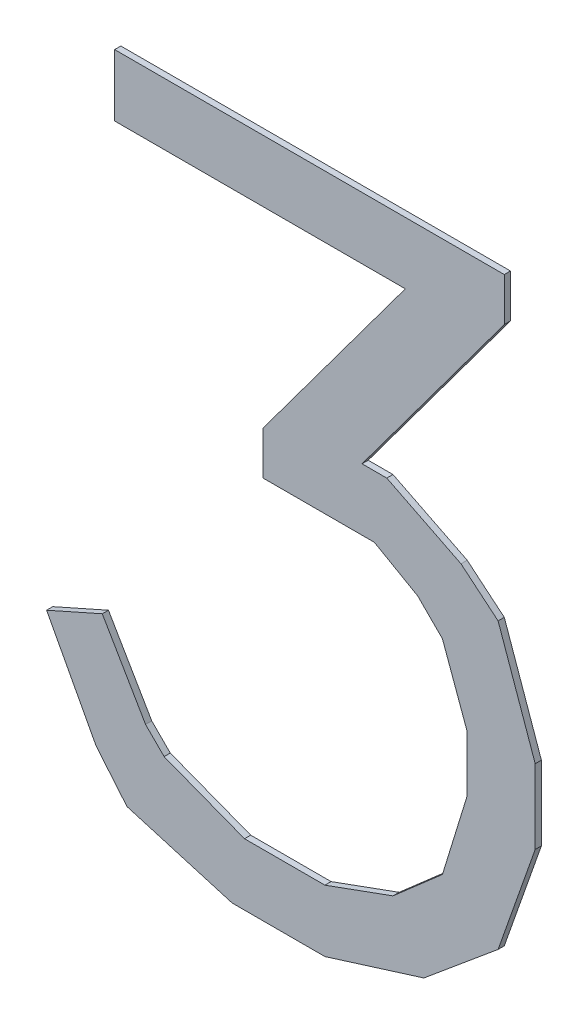
ISO-10303-21;
HEADER;
FILE_DESCRIPTION(('STEP AP214'),'2;1');
FILE_NAME('part.step','',(''),(''),'','','');
FILE_SCHEMA(('AUTOMOTIVE_DESIGN { 1 0 10303 214 1 1 1 1 }'));
ENDSEC;
DATA;
#1=APPLICATION_CONTEXT('core data for automotive mechanical design processes');
#2=APPLICATION_PROTOCOL_DEFINITION('international standard','automotive_design',2000,#1);
#3=PRODUCT_CONTEXT('',#1,'mechanical');
#4=PRODUCT('Part','Part','',(#3));
#5=PRODUCT_RELATED_PRODUCT_CATEGORY('part','',(#4));
#6=PRODUCT_DEFINITION_FORMATION('','',#4);
#7=PRODUCT_DEFINITION_CONTEXT('part definition',#1,'design');
#8=PRODUCT_DEFINITION('design','',#6,#7);
#9=PRODUCT_DEFINITION_SHAPE('','',#8);
#10=(LENGTH_UNIT() NAMED_UNIT(*) SI_UNIT(.MILLI.,.METRE.));
#11=(NAMED_UNIT(*) PLANE_ANGLE_UNIT() SI_UNIT($,.RADIAN.));
#12=(NAMED_UNIT(*) SI_UNIT($,.STERADIAN.) SOLID_ANGLE_UNIT());
#13=UNCERTAINTY_MEASURE_WITH_UNIT(LENGTH_MEASURE(1.E-05),#10,'distance_accuracy_value','');
#14=(GEOMETRIC_REPRESENTATION_CONTEXT(3) GLOBAL_UNCERTAINTY_ASSIGNED_CONTEXT((#13)) GLOBAL_UNIT_ASSIGNED_CONTEXT((#10,
#11,#12)) REPRESENTATION_CONTEXT('',''));
#15=CARTESIAN_POINT('',(0.,0.,0.));
#16=DIRECTION('',(0.,0.,1.));
#17=DIRECTION('',(1.,0.,0.));
#18=AXIS2_PLACEMENT_3D('',#15,#16,#17);
#19=CARTESIAN_POINT('',(-0.2850007,0.55000144,0.01));
#20=DIRECTION('',(0.,0.,1.));
#21=DIRECTION('',(1.,0.,0.));
#22=AXIS2_PLACEMENT_3D('',#19,#20,#21);
#23=PLANE('',#22);
#24=DIRECTION('',(1.,0.,0.));
#25=VECTOR('',#24,1.);
#26=CARTESIAN_POINT('',(0.11500104,0.1700022,0.01));
#27=LINE('',#26,#25);
#28=CARTESIAN_POINT('',(0.115001040000038,0.170002199999972,0.01));
#29=VERTEX_POINT('',#28);
#30=CARTESIAN_POINT('',(0.15500096,0.1700022,0.01));
#31=VERTEX_POINT('',#30);
#32=EDGE_CURVE('E378',#29,#31,#27,.T.);
#33=ORIENTED_EDGE('',*,*,#32,.F.);
#34=DIRECTION('',(0.595846924173071,0.803098028234095,0.));
#35=VECTOR('',#34,1.);
#36=CARTESIAN_POINT('',(0.34500058,0.48000158,0.01));
#37=LINE('',#36,#35);
#38=CARTESIAN_POINT('',(0.34500058,0.48000158,0.01));
#39=VERTEX_POINT('',#38);
#40=EDGE_CURVE('E383',#39,#29,#37,.F.);
#41=ORIENTED_EDGE('',*,*,#40,.F.);
#42=DIRECTION('',(0.,1.,0.));
#43=VECTOR('',#42,1.);
#44=CARTESIAN_POINT('',(0.34500058,0.55000144,0.01));
#45=LINE('',#44,#43);
#46=CARTESIAN_POINT('',(0.34500058,0.55000144,0.01));
#47=VERTEX_POINT('',#46);
#48=EDGE_CURVE('E226',#47,#39,#45,.F.);
#49=ORIENTED_EDGE('',*,*,#48,.F.);
#50=DIRECTION('',(1.,0.,0.));
#51=VECTOR('',#50,1.);
#52=CARTESIAN_POINT('',(-0.2850007,0.55000144,0.01));
#53=LINE('',#52,#51);
#54=CARTESIAN_POINT('',(-0.2850007,0.55000144,0.01));
#55=VERTEX_POINT('',#54);
#56=EDGE_CURVE('E20',#55,#47,#53,.T.);
#57=ORIENTED_EDGE('',*,*,#56,.F.);
#58=DIRECTION('',(0.,1.,0.));
#59=VECTOR('',#58,1.);
#60=CARTESIAN_POINT('',(-0.2850007,0.45000164,0.01));
#61=LINE('',#60,#59);
#62=CARTESIAN_POINT('',(-0.2850007,0.45000164,0.01));
#63=VERTEX_POINT('',#62);
#64=EDGE_CURVE('E223',#63,#55,#61,.T.);
#65=ORIENTED_EDGE('',*,*,#64,.F.);
#66=DIRECTION('',(1.,0.,0.));
#67=VECTOR('',#66,1.);
#68=CARTESIAN_POINT('',(0.1850009,0.45000164,0.01));
#69=LINE('',#68,#67);
#70=CARTESIAN_POINT('',(0.185000899999997,0.450001640000002,0.01));
#71=VERTEX_POINT('',#70);
#72=EDGE_CURVE('E244',#71,#63,#69,.F.);
#73=ORIENTED_EDGE('',*,*,#72,.F.);
#74=DIRECTION('',(-0.5958511681797,-0.803094879437596,0.));
#75=VECTOR('',#74,1.);
#76=CARTESIAN_POINT('',(-0.04500118,0.14000226,0.01));
#77=LINE('',#76,#75);
#78=CARTESIAN_POINT('',(-0.04500118,0.14000226,0.01));
#79=VERTEX_POINT('',#78);
#80=EDGE_CURVE('E248',#79,#71,#77,.F.);
#81=ORIENTED_EDGE('',*,*,#80,.F.);
#82=DIRECTION('',(0.,1.,0.));
#83=VECTOR('',#82,1.);
#84=CARTESIAN_POINT('',(-0.04500118,0.07000240000001,0.01));
#85=LINE('',#84,#83);
#86=CARTESIAN_POINT('',(-0.04500118,0.07000240000001,0.01));
#87=VERTEX_POINT('',#86);
#88=EDGE_CURVE('E253',#87,#79,#85,.T.);
#89=ORIENTED_EDGE('',*,*,#88,.F.);
#90=DIRECTION('',(1.,0.,0.));
#91=VECTOR('',#90,1.);
#92=CARTESIAN_POINT('',(0.135001,0.07000240000001,0.01));
#93=LINE('',#92,#91);
#94=CARTESIAN_POINT('',(0.135001000000007,0.0700024000000172,0.01));
#95=VERTEX_POINT('',#94);
#96=EDGE_CURVE('E258',#95,#87,#93,.F.);
#97=ORIENTED_EDGE('',*,*,#96,.F.);
#98=DIRECTION('',(0.868243142124275,-0.496138938357157,0.));
#99=VECTOR('',#98,1.);
#100=CARTESIAN_POINT('',(0.20500086,0.03000248000001,0.01));
#101=LINE('',#100,#99);
#102=CARTESIAN_POINT('',(0.20500086,0.0300024800000097,0.01));
#103=VERTEX_POINT('',#102);
#104=EDGE_CURVE('E263',#103,#95,#101,.F.);
#105=ORIENTED_EDGE('',*,*,#104,.F.);
#106=DIRECTION('',(0.707106781186548,-0.707106781186548,0.));
#107=VECTOR('',#106,1.);
#108=CARTESIAN_POINT('',(0.24500078,-0.009997439999992,0.01));
#109=LINE('',#108,#107);
#110=CARTESIAN_POINT('',(0.245000779999989,-0.00999744000000011,0.01));
#111=VERTEX_POINT('',#110);
#112=EDGE_CURVE('E268',#111,#103,#109,.F.);
#113=ORIENTED_EDGE('',*,*,#112,.F.);
#114=DIRECTION('',(0.341743063087106,-0.939793423488291,0.));
#115=VECTOR('',#114,1.);
#116=CARTESIAN_POINT('',(0.2850007,-0.11999722,0.01));
#117=LINE('',#116,#115);
#118=CARTESIAN_POINT('',(0.2850007,-0.11999722,0.01));
#119=VERTEX_POINT('',#118);
#120=EDGE_CURVE('E273',#119,#111,#117,.F.);
#121=ORIENTED_EDGE('',*,*,#120,.F.);
#122=DIRECTION('',(0.,1.,0.));
#123=VECTOR('',#122,1.);
#124=CARTESIAN_POINT('',(0.2850007,-0.20999958,0.01));
#125=LINE('',#124,#123);
#126=CARTESIAN_POINT('',(0.285000700000014,-0.209999580000004,0.01));
#127=VERTEX_POINT('',#126);
#128=EDGE_CURVE('E278',#127,#119,#125,.T.);
#129=ORIENTED_EDGE('',*,*,#128,.F.);
#130=DIRECTION('',(-0.294085848837945,-0.95577900872182,0.));
#131=VECTOR('',#130,1.);
#132=CARTESIAN_POINT('',(0.24500078,-0.33999932,0.01));
#133=LINE('',#132,#131);
#134=CARTESIAN_POINT('',(0.245000779999995,-0.339999319999994,0.01));
#135=VERTEX_POINT('',#134);
#136=EDGE_CURVE('E283',#135,#127,#133,.F.);
#137=ORIENTED_EDGE('',*,*,#136,.F.);
#138=DIRECTION('',(-0.752576694706692,-0.658504607868731,0.));
#139=VECTOR('',#138,1.);
#140=CARTESIAN_POINT('',(0.16500094,-0.40999918,0.01));
#141=LINE('',#140,#139);
#142=CARTESIAN_POINT('',(0.165000939999995,-0.409999179999986,0.01));
#143=VERTEX_POINT('',#142);
#144=EDGE_CURVE('E288',#143,#135,#141,.F.);
#145=ORIENTED_EDGE('',*,*,#144,.F.);
#146=DIRECTION('',(-0.939795957802303,-0.34173609364311,0.));
#147=VECTOR('',#146,1.);
#148=CARTESIAN_POINT('',(0.05499862000001,-0.4499991,0.01));
#149=LINE('',#148,#147);
#150=CARTESIAN_POINT('',(0.05499862000001,-0.4499991,0.01));
#151=VERTEX_POINT('',#150);
#152=EDGE_CURVE('E293',#151,#143,#149,.F.);
#153=ORIENTED_EDGE('',*,*,#152,.F.);
#154=DIRECTION('',(1.,0.,0.));
#155=VECTOR('',#154,1.);
#156=CARTESIAN_POINT('',(-0.07500112,-0.4499991,0.01));
#157=LINE('',#156,#155);
#158=CARTESIAN_POINT('',(-0.0750011200000019,-0.449999100000005,0.01));
#159=VERTEX_POINT('',#158);
#160=EDGE_CURVE('E298',#159,#151,#157,.T.);
#161=ORIENTED_EDGE('',*,*,#160,.F.);
#162=DIRECTION('',(-0.933345606203008,0.358979079309003,0.));
#163=VECTOR('',#162,1.);
#164=CARTESIAN_POINT('',(-0.20500086,-0.3999992,0.01));
#165=LINE('',#164,#163);
#166=CARTESIAN_POINT('',(-0.20500086,-0.3999992,0.01));
#167=VERTEX_POINT('',#166);
#168=EDGE_CURVE('E303',#167,#159,#165,.F.);
#169=ORIENTED_EDGE('',*,*,#168,.F.);
#170=DIRECTION('',(-0.707106781186548,0.707106781186548,0.));
#171=VECTOR('',#170,1.);
#172=CARTESIAN_POINT('',(-0.2350008,-0.36999926,0.01));
#173=LINE('',#172,#171);
#174=CARTESIAN_POINT('',(-0.235000799999996,-0.369999259999998,0.01));
#175=VERTEX_POINT('',#174);
#176=EDGE_CURVE('E308',#175,#167,#173,.F.);
#177=ORIENTED_EDGE('',*,*,#176,.F.);
#178=DIRECTION('',(-0.503871025524211,0.863778900898361,0.));
#179=VECTOR('',#178,1.);
#180=CARTESIAN_POINT('',(-0.30500066,-0.2499995,0.01));
#181=LINE('',#180,#179);
#182=CARTESIAN_POINT('',(-0.305000659999997,-0.249999500000007,0.01));
#183=VERTEX_POINT('',#182);
#184=EDGE_CURVE('E313',#183,#175,#181,.F.);
#185=ORIENTED_EDGE('',*,*,#184,.F.);
#186=DIRECTION('',(-0.913811548620381,-0.406138466053169,0.));
#187=VECTOR('',#186,1.);
#188=CARTESIAN_POINT('',(-0.39500048,-0.28999942,0.01));
#189=LINE('',#188,#187);
#190=CARTESIAN_POINT('',(-0.395000480000004,-0.289999420000002,0.01));
#191=VERTEX_POINT('',#190);
#192=EDGE_CURVE('E318',#191,#183,#189,.F.);
#193=ORIENTED_EDGE('',*,*,#192,.F.);
#194=DIRECTION('',(0.470588235294222,-0.882352941176415,0.));
#195=VECTOR('',#194,1.);
#196=CARTESIAN_POINT('',(-0.31500064,-0.43999912,0.01));
#197=LINE('',#196,#195);
#198=CARTESIAN_POINT('',(-0.315000639999998,-0.439999119999998,0.01));
#199=VERTEX_POINT('',#198);
#200=EDGE_CURVE('E323',#199,#191,#197,.F.);
#201=ORIENTED_EDGE('',*,*,#200,.F.);
#202=DIRECTION('',(0.640184399664382,-0.768221279597458,0.));
#203=VECTOR('',#202,1.);
#204=CARTESIAN_POINT('',(-0.26500074,-0.499999,0.01));
#205=LINE('',#204,#203);
#206=CARTESIAN_POINT('',(-0.265000739999994,-0.499998999999978,0.01));
#207=VERTEX_POINT('',#206);
#208=EDGE_CURVE('E328',#207,#199,#205,.F.);
#209=ORIENTED_EDGE('',*,*,#208,.F.);
#210=DIRECTION('',(0.959365501571127,-0.282166323992037,0.));
#211=VECTOR('',#210,1.);
#212=CARTESIAN_POINT('',(-0.09500108,-0.5499989,0.01));
#213=LINE('',#212,#211);
#214=CARTESIAN_POINT('',(-0.09500108,-0.5499989,0.01));
#215=VERTEX_POINT('',#214);
#216=EDGE_CURVE('E333',#215,#207,#213,.F.);
#217=ORIENTED_EDGE('',*,*,#216,.F.);
#218=DIRECTION('',(1.,0.,0.));
#219=VECTOR('',#218,1.);
#220=CARTESIAN_POINT('',(0.05499862000001,-0.5499989,0.01));
#221=LINE('',#220,#219);
#222=CARTESIAN_POINT('',(0.0549986200000127,-0.549998900000009,0.01));
#223=VERTEX_POINT('',#222);
#224=EDGE_CURVE('E338',#223,#215,#221,.F.);
#225=ORIENTED_EDGE('',*,*,#224,.F.);
#226=DIRECTION('',(0.954481326084,0.298270679345,0.));
#227=VECTOR('',#226,1.);
#228=CARTESIAN_POINT('',(0.21500084,-0.499999,0.01));
#229=LINE('',#228,#227);
#230=CARTESIAN_POINT('',(0.215000839999997,-0.499998999999996,0.01));
#231=VERTEX_POINT('',#230);
#232=EDGE_CURVE('E343',#231,#223,#229,.F.);
#233=ORIENTED_EDGE('',*,*,#232,.F.);
#234=DIRECTION('',(0.768221279597458,0.640184399664382,0.));
#235=VECTOR('',#234,1.);
#236=CARTESIAN_POINT('',(0.3350006,-0.3999992,0.01));
#237=LINE('',#236,#235);
#238=CARTESIAN_POINT('',(0.335000600000007,-0.399999200000002,0.01));
#239=VERTEX_POINT('',#238);
#240=EDGE_CURVE('E348',#239,#231,#237,.F.);
#241=ORIENTED_EDGE('',*,*,#240,.F.);
#242=DIRECTION('',(0.332820117734981,0.942990333582945,0.));
#243=VECTOR('',#242,1.);
#244=CARTESIAN_POINT('',(0.39500048,-0.22999954,0.01));
#245=LINE('',#244,#243);
#246=CARTESIAN_POINT('',(0.39500048,-0.22999954,0.01));
#247=VERTEX_POINT('',#246);
#248=EDGE_CURVE('E353',#247,#239,#245,.F.);
#249=ORIENTED_EDGE('',*,*,#248,.F.);
#250=DIRECTION('',(0.,1.,0.));
#251=VECTOR('',#250,1.);
#252=CARTESIAN_POINT('',(0.39500048,-0.10999724,0.01));
#253=LINE('',#252,#251);
#254=CARTESIAN_POINT('',(0.395000479999993,-0.109997240000003,0.01));
#255=VERTEX_POINT('',#254);
#256=EDGE_CURVE('E358',#255,#247,#253,.F.);
#257=ORIENTED_EDGE('',*,*,#256,.F.);
#258=DIRECTION('',(-0.332820117734981,0.942990333582945,0.));
#259=VECTOR('',#258,1.);
#260=CARTESIAN_POINT('',(0.3350006,0.06000242,0.01));
#261=LINE('',#260,#259);
#262=CARTESIAN_POINT('',(0.335000600000002,0.0600024200000019,0.01));
#263=VERTEX_POINT('',#262);
#264=EDGE_CURVE('E363',#263,#255,#261,.F.);
#265=ORIENTED_EDGE('',*,*,#264,.F.);
#266=DIRECTION('',(-0.768221279597458,0.640184399664382,0.));
#267=VECTOR('',#266,1.);
#268=CARTESIAN_POINT('',(0.27500072,0.11000232,0.01));
#269=LINE('',#268,#267);
#270=CARTESIAN_POINT('',(0.27500072,0.11000232,0.01));
#271=VERTEX_POINT('',#270);
#272=EDGE_CURVE('E368',#271,#263,#269,.F.);
#273=ORIENTED_EDGE('',*,*,#272,.F.);
#274=DIRECTION('',(-0.894427190999916,0.447213595499958,0.));
#275=VECTOR('',#274,1.);
#276=CARTESIAN_POINT('',(0.15500096,0.1700022,0.01));
#277=LINE('',#276,#275);
#278=EDGE_CURVE('E373',#31,#271,#277,.F.);
#279=ORIENTED_EDGE('',*,*,#278,.F.);
#280=EDGE_LOOP('',(#33,#41,#49,#57,#65,#73,#81,#89,#97,#105,#113,#121,#129,#137,#145,#153,#161,
#169,#177,#185,#193,#201,#209,#217,#225,#233,#241,#249,#257,#265,#273,#279));
#281=FACE_BOUND('',#280,.T.);
#282=ADVANCED_FACE('F17',(#281),#23,.T.);
#283=CARTESIAN_POINT('',(-0.2850007,0.55000144,0.));
#284=DIRECTION('',(0.,1.,0.));
#285=DIRECTION('',(0.,0.,1.));
#286=AXIS2_PLACEMENT_3D('',#283,#284,#285);
#287=PLANE('',#286);
#288=DIRECTION('',(0.,0.,1.));
#289=VECTOR('',#288,1.);
#290=CARTESIAN_POINT('',(-0.2850007,0.55000144,0.));
#291=LINE('',#290,#289);
#292=CARTESIAN_POINT('',(-0.2850007,0.55000144,0.));
#293=VERTEX_POINT('',#292);
#294=EDGE_CURVE('E231',#55,#293,#291,.F.);
#295=ORIENTED_EDGE('',*,*,#294,.F.);
#296=ORIENTED_EDGE('',*,*,#56,.T.);
#297=DIRECTION('',(0.,0.,-1.));
#298=VECTOR('',#297,1.);
#299=CARTESIAN_POINT('',(0.34500058,0.55000144,0.));
#300=LINE('',#299,#298);
#301=CARTESIAN_POINT('',(0.34500058,0.55000144,0.));
#302=VERTEX_POINT('',#301);
#303=EDGE_CURVE('E387',#302,#47,#300,.F.);
#304=ORIENTED_EDGE('',*,*,#303,.F.);
#305=DIRECTION('',(1.,0.,0.));
#306=VECTOR('',#305,1.);
#307=CARTESIAN_POINT('',(-0.2850007,0.55000144,0.));
#308=LINE('',#307,#306);
#309=EDGE_CURVE('E241',#302,#293,#308,.F.);
#310=ORIENTED_EDGE('',*,*,#309,.T.);
#311=EDGE_LOOP('',(#295,#296,#304,#310));
#312=FACE_BOUND('',#311,.T.);
#313=ADVANCED_FACE('F240',(#312),#287,.T.);
#314=CARTESIAN_POINT('',(-0.2850007,0.45000164,0.));
#315=DIRECTION('',(-1.,0.,0.));
#316=DIRECTION('',(0.,0.,1.));
#317=AXIS2_PLACEMENT_3D('',#314,#315,#316);
#318=PLANE('',#317);
#319=DIRECTION('',(0.,0.,-1.));
#320=VECTOR('',#319,1.);
#321=CARTESIAN_POINT('',(-0.2850007,0.45000164,0.));
#322=LINE('',#321,#320);
#323=CARTESIAN_POINT('',(-0.2850007,0.45000164,0.));
#324=VERTEX_POINT('',#323);
#325=EDGE_CURVE('E237',#63,#324,#322,.T.);
#326=ORIENTED_EDGE('',*,*,#325,.F.);
#327=ORIENTED_EDGE('',*,*,#64,.T.);
#328=ORIENTED_EDGE('',*,*,#294,.T.);
#329=DIRECTION('',(0.,1.,0.));
#330=VECTOR('',#329,1.);
#331=CARTESIAN_POINT('',(-0.2850007,0.55000144,0.));
#332=LINE('',#331,#330);
#333=EDGE_CURVE('E391',#293,#324,#332,.F.);
#334=ORIENTED_EDGE('',*,*,#333,.T.);
#335=EDGE_LOOP('',(#326,#327,#328,#334));
#336=FACE_BOUND('',#335,.T.);
#337=ADVANCED_FACE('F234',(#336),#318,.T.);
#338=CARTESIAN_POINT('',(0.1850009,0.45000164,0.));
#339=DIRECTION('',(0.,-1.,0.));
#340=DIRECTION('',(0.,0.,-1.));
#341=AXIS2_PLACEMENT_3D('',#338,#339,#340);
#342=PLANE('',#341);
#343=DIRECTION('',(0.,0.,1.));
#344=VECTOR('',#343,1.);
#345=CARTESIAN_POINT('',(0.185000899999989,0.450001640000008,0.));
#346=LINE('',#345,#344);
#347=CARTESIAN_POINT('',(0.185000899999997,0.450001640000002,0.));
#348=VERTEX_POINT('',#347);
#349=EDGE_CURVE('E246',#71,#348,#346,.F.);
#350=ORIENTED_EDGE('',*,*,#349,.F.);
#351=ORIENTED_EDGE('',*,*,#72,.T.);
#352=ORIENTED_EDGE('',*,*,#325,.T.);
#353=DIRECTION('',(1.,0.,0.));
#354=VECTOR('',#353,1.);
#355=CARTESIAN_POINT('',(-0.2850007,0.45000164,0.));
#356=LINE('',#355,#354);
#357=EDGE_CURVE('E393',#324,#348,#356,.T.);
#358=ORIENTED_EDGE('',*,*,#357,.T.);
#359=EDGE_LOOP('',(#350,#351,#352,#358));
#360=FACE_BOUND('',#359,.T.);
#361=ADVANCED_FACE('F594',(#360),#342,.T.);
#362=CARTESIAN_POINT('',(-0.04500118,0.14000226,0.));
#363=DIRECTION('',(-0.803094879437596,0.5958511681797,0.));
#364=DIRECTION('',(-0.5958511681797,-0.803094879437596,0.));
#365=AXIS2_PLACEMENT_3D('',#362,#363,#364);
#366=PLANE('',#365);
#367=DIRECTION('',(0.,0.,1.));
#368=VECTOR('',#367,1.);
#369=CARTESIAN_POINT('',(-0.04500118,0.14000226,0.));
#370=LINE('',#369,#368);
#371=CARTESIAN_POINT('',(-0.04500118,0.14000226,0.));
#372=VERTEX_POINT('',#371);
#373=EDGE_CURVE('E251',#79,#372,#370,.F.);
#374=ORIENTED_EDGE('',*,*,#373,.F.);
#375=ORIENTED_EDGE('',*,*,#80,.T.);
#376=ORIENTED_EDGE('',*,*,#349,.T.);
#377=DIRECTION('',(-0.595851168179728,-0.803094879437575,0.));
#378=VECTOR('',#377,1.);
#379=CARTESIAN_POINT('',(0.1850009,0.45000164,0.));
#380=LINE('',#379,#378);
#381=EDGE_CURVE('E396',#348,#372,#380,.T.);
#382=ORIENTED_EDGE('',*,*,#381,.T.);
#383=EDGE_LOOP('',(#374,#375,#376,#382));
#384=FACE_BOUND('',#383,.T.);
#385=ADVANCED_FACE('F591',(#384),#366,.T.);
#386=CARTESIAN_POINT('',(-0.04500118,0.07000240000001,0.));
#387=DIRECTION('',(-1.,0.,0.));
#388=DIRECTION('',(0.,0.,1.));
#389=AXIS2_PLACEMENT_3D('',#386,#387,#388);
#390=PLANE('',#389);
#391=DIRECTION('',(0.,0.,-1.));
#392=VECTOR('',#391,1.);
#393=CARTESIAN_POINT('',(-0.04500118,0.07000240000001,0.));
#394=LINE('',#393,#392);
#395=CARTESIAN_POINT('',(-0.04500118,0.07000240000001,0.));
#396=VERTEX_POINT('',#395);
#397=EDGE_CURVE('E256',#87,#396,#394,.T.);
#398=ORIENTED_EDGE('',*,*,#397,.F.);
#399=ORIENTED_EDGE('',*,*,#88,.T.);
#400=ORIENTED_EDGE('',*,*,#373,.T.);
#401=DIRECTION('',(0.,1.,0.));
#402=VECTOR('',#401,1.);
#403=CARTESIAN_POINT('',(-0.04500118,0.55000144,0.));
#404=LINE('',#403,#402);
#405=EDGE_CURVE('E399',#372,#396,#404,.F.);
#406=ORIENTED_EDGE('',*,*,#405,.T.);
#407=EDGE_LOOP('',(#398,#399,#400,#406));
#408=FACE_BOUND('',#407,.T.);
#409=ADVANCED_FACE('F586',(#408),#390,.T.);
#410=CARTESIAN_POINT('',(0.135001,0.07000240000001,0.));
#411=DIRECTION('',(0.,-1.,0.));
#412=DIRECTION('',(0.,0.,-1.));
#413=AXIS2_PLACEMENT_3D('',#410,#411,#412);
#414=PLANE('',#413);
#415=DIRECTION('',(0.,0.,1.));
#416=VECTOR('',#415,1.);
#417=CARTESIAN_POINT('',(0.135001000000011,0.0700024000000385,0.));
#418=LINE('',#417,#416);
#419=CARTESIAN_POINT('',(0.135001000000007,0.0700024000000172,0.));
#420=VERTEX_POINT('',#419);
#421=EDGE_CURVE('E261',#95,#420,#418,.F.);
#422=ORIENTED_EDGE('',*,*,#421,.F.);
#423=ORIENTED_EDGE('',*,*,#96,.T.);
#424=ORIENTED_EDGE('',*,*,#397,.T.);
#425=DIRECTION('',(1.,0.,0.));
#426=VECTOR('',#425,1.);
#427=CARTESIAN_POINT('',(-0.2850007,0.07000240000001,0.));
#428=LINE('',#427,#426);
#429=EDGE_CURVE('E402',#396,#420,#428,.T.);
#430=ORIENTED_EDGE('',*,*,#429,.T.);
#431=EDGE_LOOP('',(#422,#423,#424,#430));
#432=FACE_BOUND('',#431,.T.);
#433=ADVANCED_FACE('F583',(#432),#414,.T.);
#434=CARTESIAN_POINT('',(0.20500086,0.03000248000001,0.));
#435=DIRECTION('',(-0.496138938357157,-0.868243142124275,0.));
#436=DIRECTION('',(0.868243142124275,-0.496138938357157,0.));
#437=AXIS2_PLACEMENT_3D('',#434,#435,#436);
#438=PLANE('',#437);
#439=DIRECTION('',(0.,0.,1.));
#440=VECTOR('',#439,1.);
#441=CARTESIAN_POINT('',(0.205000859999999,0.030002480000009,0.));
#442=LINE('',#441,#440);
#443=CARTESIAN_POINT('',(0.20500086,0.0300024800000097,0.));
#444=VERTEX_POINT('',#443);
#445=EDGE_CURVE('E266',#103,#444,#442,.F.);
#446=ORIENTED_EDGE('',*,*,#445,.F.);
#447=ORIENTED_EDGE('',*,*,#104,.T.);
#448=ORIENTED_EDGE('',*,*,#421,.T.);
#449=DIRECTION('',(0.868243142124406,-0.496138938356927,0.));
#450=VECTOR('',#449,1.);
#451=CARTESIAN_POINT('',(0.135001,0.07000240000002,0.));
#452=LINE('',#451,#450);
#453=EDGE_CURVE('E405',#420,#444,#452,.T.);
#454=ORIENTED_EDGE('',*,*,#453,.T.);
#455=EDGE_LOOP('',(#446,#447,#448,#454));
#456=FACE_BOUND('',#455,.T.);
#457=ADVANCED_FACE('F578',(#456),#438,.T.);
#458=CARTESIAN_POINT('',(0.24500078,-0.009997439999992,0.));
#459=DIRECTION('',(-0.707106781186548,-0.707106781186548,0.));
#460=DIRECTION('',(0.707106781186548,-0.707106781186548,0.));
#461=AXIS2_PLACEMENT_3D('',#458,#459,#460);
#462=PLANE('',#461);
#463=DIRECTION('',(0.,0.,1.));
#464=VECTOR('',#463,1.);
#465=CARTESIAN_POINT('',(0.245000779999952,-0.00999744000001443,0.));
#466=LINE('',#465,#464);
#467=CARTESIAN_POINT('',(0.245000779999989,-0.00999744000000011,0.));
#468=VERTEX_POINT('',#467);
#469=EDGE_CURVE('E271',#111,#468,#466,.F.);
#470=ORIENTED_EDGE('',*,*,#469,.F.);
#471=ORIENTED_EDGE('',*,*,#112,.T.);
#472=ORIENTED_EDGE('',*,*,#445,.T.);
#473=DIRECTION('',(0.707106781186485,-0.70710678118661,0.));
#474=VECTOR('',#473,1.);
#475=CARTESIAN_POINT('',(0.20500086,0.03000248000001,0.));
#476=LINE('',#475,#474);
#477=EDGE_CURVE('E408',#444,#468,#476,.T.);
#478=ORIENTED_EDGE('',*,*,#477,.T.);
#479=EDGE_LOOP('',(#470,#471,#472,#478));
#480=FACE_BOUND('',#479,.T.);
#481=ADVANCED_FACE('F575',(#480),#462,.T.);
#482=CARTESIAN_POINT('',(0.2850007,-0.11999722,0.));
#483=DIRECTION('',(-0.939793423488291,-0.341743063087106,0.));
#484=DIRECTION('',(0.341743063087106,-0.939793423488291,0.));
#485=AXIS2_PLACEMENT_3D('',#482,#483,#484);
#486=PLANE('',#485);
#487=DIRECTION('',(0.,0.,1.));
#488=VECTOR('',#487,1.);
#489=CARTESIAN_POINT('',(0.2850007,-0.11999722,0.));
#490=LINE('',#489,#488);
#491=CARTESIAN_POINT('',(0.2850007,-0.11999722,0.));
#492=VERTEX_POINT('',#491);
#493=EDGE_CURVE('E276',#119,#492,#490,.F.);
#494=ORIENTED_EDGE('',*,*,#493,.F.);
#495=ORIENTED_EDGE('',*,*,#120,.T.);
#496=ORIENTED_EDGE('',*,*,#469,.T.);
#497=DIRECTION('',(0.341743063086696,-0.93979342348844,0.));
#498=VECTOR('',#497,1.);
#499=CARTESIAN_POINT('',(0.24500078,-0.00999743999999703,0.));
#500=LINE('',#499,#498);
#501=EDGE_CURVE('E411',#468,#492,#500,.T.);
#502=ORIENTED_EDGE('',*,*,#501,.T.);
#503=EDGE_LOOP('',(#494,#495,#496,#502));
#504=FACE_BOUND('',#503,.T.);
#505=ADVANCED_FACE('F570',(#504),#486,.T.);
#506=CARTESIAN_POINT('',(0.2850007,-0.20999958,0.));
#507=DIRECTION('',(-1.,0.,0.));
#508=DIRECTION('',(0.,0.,1.));
#509=AXIS2_PLACEMENT_3D('',#506,#507,#508);
#510=PLANE('',#509);
#511=DIRECTION('',(0.,0.,1.));
#512=VECTOR('',#511,1.);
#513=CARTESIAN_POINT('',(0.285000700000057,-0.209999580000018,0.));
#514=LINE('',#513,#512);
#515=CARTESIAN_POINT('',(0.285000700000014,-0.209999580000004,0.));
#516=VERTEX_POINT('',#515);
#517=EDGE_CURVE('E281',#127,#516,#514,.F.);
#518=ORIENTED_EDGE('',*,*,#517,.F.);
#519=ORIENTED_EDGE('',*,*,#128,.T.);
#520=ORIENTED_EDGE('',*,*,#493,.T.);
#521=DIRECTION('',(0.,1.,0.));
#522=VECTOR('',#521,1.);
#523=CARTESIAN_POINT('',(0.2850007,0.55000144,0.));
#524=LINE('',#523,#522);
#525=EDGE_CURVE('E414',#492,#516,#524,.F.);
#526=ORIENTED_EDGE('',*,*,#525,.T.);
#527=EDGE_LOOP('',(#518,#519,#520,#526));
#528=FACE_BOUND('',#527,.T.);
#529=ADVANCED_FACE('F567',(#528),#510,.T.);
#530=CARTESIAN_POINT('',(0.24500078,-0.33999932,0.));
#531=DIRECTION('',(-0.95577900872182,0.294085848837945,0.));
#532=DIRECTION('',(-0.294085848837945,-0.95577900872182,0.));
#533=AXIS2_PLACEMENT_3D('',#530,#531,#532);
#534=PLANE('',#533);
#535=DIRECTION('',(0.,0.,1.));
#536=VECTOR('',#535,1.);
#537=CARTESIAN_POINT('',(0.24500077999998,-0.339999319999977,0.));
#538=LINE('',#537,#536);
#539=CARTESIAN_POINT('',(0.245000779999995,-0.339999319999994,0.));
#540=VERTEX_POINT('',#539);
#541=EDGE_CURVE('E286',#135,#540,#538,.F.);
#542=ORIENTED_EDGE('',*,*,#541,.F.);
#543=ORIENTED_EDGE('',*,*,#136,.T.);
#544=ORIENTED_EDGE('',*,*,#517,.T.);
#545=DIRECTION('',(-0.294085848837523,-0.95577900872195,0.));
#546=VECTOR('',#545,1.);
#547=CARTESIAN_POINT('',(0.2850007,-0.20999958,0.));
#548=LINE('',#547,#546);
#549=EDGE_CURVE('E417',#516,#540,#548,.T.);
#550=ORIENTED_EDGE('',*,*,#549,.T.);
#551=EDGE_LOOP('',(#542,#543,#544,#550));
#552=FACE_BOUND('',#551,.T.);
#553=ADVANCED_FACE('F562',(#552),#534,.T.);
#554=CARTESIAN_POINT('',(0.16500094,-0.40999918,0.));
#555=DIRECTION('',(-0.658504607868731,0.752576694706692,0.));
#556=DIRECTION('',(-0.752576694706692,-0.658504607868731,0.));
#557=AXIS2_PLACEMENT_3D('',#554,#555,#556);
#558=PLANE('',#557);
#559=DIRECTION('',(0.,0.,1.));
#560=VECTOR('',#559,1.);
#561=CARTESIAN_POINT('',(0.165000939999979,-0.409999179999943,0.));
#562=LINE('',#561,#560);
#563=CARTESIAN_POINT('',(0.165000939999995,-0.409999179999986,0.));
#564=VERTEX_POINT('',#563);
#565=EDGE_CURVE('E291',#143,#564,#562,.F.);
#566=ORIENTED_EDGE('',*,*,#565,.F.);
#567=ORIENTED_EDGE('',*,*,#144,.T.);
#568=ORIENTED_EDGE('',*,*,#541,.T.);
#569=DIRECTION('',(-0.752576694706878,-0.658504607868518,0.));
#570=VECTOR('',#569,1.);
#571=CARTESIAN_POINT('',(0.24500078,-0.33999932,0.));
#572=LINE('',#571,#570);
#573=EDGE_CURVE('E420',#540,#564,#572,.T.);
#574=ORIENTED_EDGE('',*,*,#573,.T.);
#575=EDGE_LOOP('',(#566,#567,#568,#574));
#576=FACE_BOUND('',#575,.T.);
#577=ADVANCED_FACE('F559',(#576),#558,.T.);
#578=CARTESIAN_POINT('',(0.05499862000001,-0.4499991,0.));
#579=DIRECTION('',(-0.34173609364311,0.939795957802303,0.));
#580=DIRECTION('',(-0.939795957802303,-0.34173609364311,0.));
#581=AXIS2_PLACEMENT_3D('',#578,#579,#580);
#582=PLANE('',#581);
#583=DIRECTION('',(0.,0.,1.));
#584=VECTOR('',#583,1.);
#585=CARTESIAN_POINT('',(0.05499862000001,-0.4499991,0.));
#586=LINE('',#585,#584);
#587=CARTESIAN_POINT('',(0.05499862000001,-0.4499991,0.));
#588=VERTEX_POINT('',#587);
#589=EDGE_CURVE('E296',#151,#588,#586,.F.);
#590=ORIENTED_EDGE('',*,*,#589,.F.);
#591=ORIENTED_EDGE('',*,*,#152,.T.);
#592=ORIENTED_EDGE('',*,*,#565,.T.);
#593=DIRECTION('',(-0.939795957802479,-0.341736093642625,0.));
#594=VECTOR('',#593,1.);
#595=CARTESIAN_POINT('',(0.16500094,-0.40999918,0.));
#596=LINE('',#595,#594);
#597=EDGE_CURVE('E423',#564,#588,#596,.T.);
#598=ORIENTED_EDGE('',*,*,#597,.T.);
#599=EDGE_LOOP('',(#590,#591,#592,#598));
#600=FACE_BOUND('',#599,.T.);
#601=ADVANCED_FACE('F554',(#600),#582,.T.);
#602=CARTESIAN_POINT('',(-0.07500112,-0.4499991,0.));
#603=DIRECTION('',(0.,1.,0.));
#604=DIRECTION('',(0.,0.,1.));
#605=AXIS2_PLACEMENT_3D('',#602,#603,#604);
#606=PLANE('',#605);
#607=DIRECTION('',(0.,0.,1.));
#608=VECTOR('',#607,1.);
#609=CARTESIAN_POINT('',(-0.0750011200000072,-0.449999100000019,0.));
#610=LINE('',#609,#608);
#611=CARTESIAN_POINT('',(-0.0750011200000019,-0.449999100000005,0.));
#612=VERTEX_POINT('',#611);
#613=EDGE_CURVE('E301',#159,#612,#610,.F.);
#614=ORIENTED_EDGE('',*,*,#613,.F.);
#615=ORIENTED_EDGE('',*,*,#160,.T.);
#616=ORIENTED_EDGE('',*,*,#589,.T.);
#617=DIRECTION('',(1.,0.,0.));
#618=VECTOR('',#617,1.);
#619=CARTESIAN_POINT('',(-0.2850007,-0.4499991,0.));
#620=LINE('',#619,#618);
#621=EDGE_CURVE('E426',#588,#612,#620,.F.);
#622=ORIENTED_EDGE('',*,*,#621,.T.);
#623=EDGE_LOOP('',(#614,#615,#616,#622));
#624=FACE_BOUND('',#623,.T.);
#625=ADVANCED_FACE('F551',(#624),#606,.T.);
#626=CARTESIAN_POINT('',(-0.20500086,-0.3999992,0.));
#627=DIRECTION('',(0.358979079309003,0.933345606203008,0.));
#628=DIRECTION('',(-0.933345606203008,0.358979079309003,0.));
#629=AXIS2_PLACEMENT_3D('',#626,#627,#628);
#630=PLANE('',#629);
#631=DIRECTION('',(0.,0.,1.));
#632=VECTOR('',#631,1.);
#633=CARTESIAN_POINT('',(-0.20500086,-0.3999992,0.));
#634=LINE('',#633,#632);
#635=CARTESIAN_POINT('',(-0.20500086,-0.3999992,0.));
#636=VERTEX_POINT('',#635);
#637=EDGE_CURVE('E306',#167,#636,#634,.F.);
#638=ORIENTED_EDGE('',*,*,#637,.F.);
#639=ORIENTED_EDGE('',*,*,#168,.T.);
#640=ORIENTED_EDGE('',*,*,#613,.T.);
#641=DIRECTION('',(-0.933345606203059,0.35897907930887,0.));
#642=VECTOR('',#641,1.);
#643=CARTESIAN_POINT('',(-0.07500112,-0.4499991,0.));
#644=LINE('',#643,#642);
#645=EDGE_CURVE('E429',#612,#636,#644,.T.);
#646=ORIENTED_EDGE('',*,*,#645,.T.);
#647=EDGE_LOOP('',(#638,#639,#640,#646));
#648=FACE_BOUND('',#647,.T.);
#649=ADVANCED_FACE('F546',(#648),#630,.T.);
#650=CARTESIAN_POINT('',(-0.2350008,-0.36999926,0.));
#651=DIRECTION('',(0.707106781186548,0.707106781186548,0.));
#652=DIRECTION('',(-0.707106781186548,0.707106781186548,0.));
#653=AXIS2_PLACEMENT_3D('',#650,#651,#652);
#654=PLANE('',#653);
#655=DIRECTION('',(0.,0.,1.));
#656=VECTOR('',#655,1.);
#657=CARTESIAN_POINT('',(-0.235000799999983,-0.36999925999999,0.));
#658=LINE('',#657,#656);
#659=CARTESIAN_POINT('',(-0.235000799999996,-0.369999259999998,0.));
#660=VERTEX_POINT('',#659);
#661=EDGE_CURVE('E311',#175,#660,#658,.F.);
#662=ORIENTED_EDGE('',*,*,#661,.F.);
#663=ORIENTED_EDGE('',*,*,#176,.T.);
#664=ORIENTED_EDGE('',*,*,#637,.T.);
#665=DIRECTION('',(-0.707106781186548,0.707106781186547,0.));
#666=VECTOR('',#665,1.);
#667=CARTESIAN_POINT('',(-0.20500086,-0.3999992,0.));
#668=LINE('',#667,#666);
#669=EDGE_CURVE('E432',#636,#660,#668,.T.);
#670=ORIENTED_EDGE('',*,*,#669,.T.);
#671=EDGE_LOOP('',(#662,#663,#664,#670));
#672=FACE_BOUND('',#671,.T.);
#673=ADVANCED_FACE('F543',(#672),#654,.T.);
#674=CARTESIAN_POINT('',(-0.30500066,-0.2499995,0.));
#675=DIRECTION('',(0.863778900898361,0.503871025524211,0.));
#676=DIRECTION('',(-0.503871025524211,0.863778900898361,0.));
#677=AXIS2_PLACEMENT_3D('',#674,#675,#676);
#678=PLANE('',#677);
#679=DIRECTION('',(0.,0.,1.));
#680=VECTOR('',#679,1.);
#681=CARTESIAN_POINT('',(-0.305000659999988,-0.249999500000027,0.));
#682=LINE('',#681,#680);
#683=CARTESIAN_POINT('',(-0.305000659999997,-0.249999500000007,0.));
#684=VERTEX_POINT('',#683);
#685=EDGE_CURVE('E316',#183,#684,#682,.F.);
#686=ORIENTED_EDGE('',*,*,#685,.F.);
#687=ORIENTED_EDGE('',*,*,#184,.T.);
#688=ORIENTED_EDGE('',*,*,#661,.T.);
#689=DIRECTION('',(-0.503871025524086,0.863778900898434,0.));
#690=VECTOR('',#689,1.);
#691=CARTESIAN_POINT('',(-0.2350008,-0.36999926,0.));
#692=LINE('',#691,#690);
#693=EDGE_CURVE('E435',#660,#684,#692,.T.);
#694=ORIENTED_EDGE('',*,*,#693,.T.);
#695=EDGE_LOOP('',(#686,#687,#688,#694));
#696=FACE_BOUND('',#695,.T.);
#697=ADVANCED_FACE('F538',(#696),#678,.T.);
#698=CARTESIAN_POINT('',(-0.39500048,-0.28999942,0.));
#699=DIRECTION('',(-0.406138466053169,0.913811548620381,0.));
#700=DIRECTION('',(-0.913811548620381,-0.406138466053169,0.));
#701=AXIS2_PLACEMENT_3D('',#698,#699,#700);
#702=PLANE('',#701);
#703=DIRECTION('',(0.,0.,1.));
#704=VECTOR('',#703,1.);
#705=CARTESIAN_POINT('',(-0.395000480000018,-0.289999420000009,0.));
#706=LINE('',#705,#704);
#707=CARTESIAN_POINT('',(-0.395000480000004,-0.289999420000002,0.));
#708=VERTEX_POINT('',#707);
#709=EDGE_CURVE('E321',#191,#708,#706,.F.);
#710=ORIENTED_EDGE('',*,*,#709,.F.);
#711=ORIENTED_EDGE('',*,*,#192,.T.);
#712=ORIENTED_EDGE('',*,*,#685,.T.);
#713=DIRECTION('',(-0.913811548620257,-0.406138466053448,0.));
#714=VECTOR('',#713,1.);
#715=CARTESIAN_POINT('',(-0.30500066,-0.2499995,0.));
#716=LINE('',#715,#714);
#717=EDGE_CURVE('E438',#684,#708,#716,.T.);
#718=ORIENTED_EDGE('',*,*,#717,.T.);
#719=EDGE_LOOP('',(#710,#711,#712,#718));
#720=FACE_BOUND('',#719,.T.);
#721=ADVANCED_FACE('F535',(#720),#702,.T.);
#722=CARTESIAN_POINT('',(-0.31500064,-0.43999912,0.));
#723=DIRECTION('',(-0.882352941176415,-0.470588235294222,0.));
#724=DIRECTION('',(0.470588235294222,-0.882352941176415,0.));
#725=AXIS2_PLACEMENT_3D('',#722,#723,#724);
#726=PLANE('',#725);
#727=DIRECTION('',(0.,0.,1.));
#728=VECTOR('',#727,1.);
#729=CARTESIAN_POINT('',(-0.315000639999992,-0.439999119999994,0.));
#730=LINE('',#729,#728);
#731=CARTESIAN_POINT('',(-0.315000639999998,-0.439999119999998,0.));
#732=VERTEX_POINT('',#731);
#733=EDGE_CURVE('E326',#199,#732,#730,.F.);
#734=ORIENTED_EDGE('',*,*,#733,.F.);
#735=ORIENTED_EDGE('',*,*,#200,.T.);
#736=ORIENTED_EDGE('',*,*,#709,.T.);
#737=DIRECTION('',(0.470588235294117,-0.882352941176471,0.));
#738=VECTOR('',#737,1.);
#739=CARTESIAN_POINT('',(-0.39500048,-0.28999942,0.));
#740=LINE('',#739,#738);
#741=EDGE_CURVE('E441',#708,#732,#740,.T.);
#742=ORIENTED_EDGE('',*,*,#741,.T.);
#743=EDGE_LOOP('',(#734,#735,#736,#742));
#744=FACE_BOUND('',#743,.T.);
#745=ADVANCED_FACE('F530',(#744),#726,.T.);
#746=CARTESIAN_POINT('',(-0.26500074,-0.499999,0.));
#747=DIRECTION('',(-0.768221279597458,-0.640184399664382,0.));
#748=DIRECTION('',(0.640184399664382,-0.768221279597458,0.));
#749=AXIS2_PLACEMENT_3D('',#746,#747,#748);
#750=PLANE('',#749);
#751=DIRECTION('',(0.,0.,1.));
#752=VECTOR('',#751,1.);
#753=CARTESIAN_POINT('',(-0.265000739999975,-0.499998999999914,0.));
#754=LINE('',#753,#752);
#755=CARTESIAN_POINT('',(-0.265000739999994,-0.499998999999978,0.));
#756=VERTEX_POINT('',#755);
#757=EDGE_CURVE('E331',#207,#756,#754,.F.);
#758=ORIENTED_EDGE('',*,*,#757,.F.);
#759=ORIENTED_EDGE('',*,*,#208,.T.);
#760=ORIENTED_EDGE('',*,*,#733,.T.);
#761=DIRECTION('',(0.64018439966448,-0.768221279597376,0.));
#762=VECTOR('',#761,1.);
#763=CARTESIAN_POINT('',(-0.31500064,-0.43999912,0.));
#764=LINE('',#763,#762);
#765=EDGE_CURVE('E444',#732,#756,#764,.T.);
#766=ORIENTED_EDGE('',*,*,#765,.T.);
#767=EDGE_LOOP('',(#758,#759,#760,#766));
#768=FACE_BOUND('',#767,.T.);
#769=ADVANCED_FACE('F527',(#768),#750,.T.);
#770=CARTESIAN_POINT('',(-0.09500108,-0.5499989,0.));
#771=DIRECTION('',(-0.282166323992037,-0.959365501571127,0.));
#772=DIRECTION('',(0.959365501571127,-0.282166323992037,0.));
#773=AXIS2_PLACEMENT_3D('',#770,#771,#772);
#774=PLANE('',#773);
#775=DIRECTION('',(0.,0.,-1.));
#776=VECTOR('',#775,1.);
#777=CARTESIAN_POINT('',(-0.09500108,-0.5499989,0.));
#778=LINE('',#777,#776);
#779=CARTESIAN_POINT('',(-0.09500108,-0.5499989,0.));
#780=VERTEX_POINT('',#779);
#781=EDGE_CURVE('E336',#215,#780,#778,.T.);
#782=ORIENTED_EDGE('',*,*,#781,.F.);
#783=ORIENTED_EDGE('',*,*,#216,.T.);
#784=ORIENTED_EDGE('',*,*,#757,.T.);
#785=DIRECTION('',(0.959365501571271,-0.28216632399155,0.));
#786=VECTOR('',#785,1.);
#787=CARTESIAN_POINT('',(-0.26500074,-0.499999,0.));
#788=LINE('',#787,#786);
#789=EDGE_CURVE('E447',#756,#780,#788,.T.);
#790=ORIENTED_EDGE('',*,*,#789,.T.);
#791=EDGE_LOOP('',(#782,#783,#784,#790));
#792=FACE_BOUND('',#791,.T.);
#793=ADVANCED_FACE('F522',(#792),#774,.T.);
#794=CARTESIAN_POINT('',(0.05499862000001,-0.5499989,0.));
#795=DIRECTION('',(0.,-1.,0.));
#796=DIRECTION('',(0.,0.,-1.));
#797=AXIS2_PLACEMENT_3D('',#794,#795,#796);
#798=PLANE('',#797);
#799=DIRECTION('',(0.,0.,1.));
#800=VECTOR('',#799,1.);
#801=CARTESIAN_POINT('',(0.0549986200000213,-0.549998900000036,0.));
#802=LINE('',#801,#800);
#803=CARTESIAN_POINT('',(0.0549986200000127,-0.549998900000009,0.));
#804=VERTEX_POINT('',#803);
#805=EDGE_CURVE('E341',#223,#804,#802,.F.);
#806=ORIENTED_EDGE('',*,*,#805,.F.);
#807=ORIENTED_EDGE('',*,*,#224,.T.);
#808=ORIENTED_EDGE('',*,*,#781,.T.);
#809=DIRECTION('',(1.,0.,0.));
#810=VECTOR('',#809,1.);
#811=CARTESIAN_POINT('',(-0.2850007,-0.5499989,0.));
#812=LINE('',#811,#810);
#813=EDGE_CURVE('E450',#780,#804,#812,.T.);
#814=ORIENTED_EDGE('',*,*,#813,.T.);
#815=EDGE_LOOP('',(#806,#807,#808,#814));
#816=FACE_BOUND('',#815,.T.);
#817=ADVANCED_FACE('F519',(#816),#798,.T.);
#818=CARTESIAN_POINT('',(0.21500084,-0.499999,0.));
#819=DIRECTION('',(0.298270679345,-0.954481326084,0.));
#820=DIRECTION('',(0.954481326084,0.298270679345,0.));
#821=AXIS2_PLACEMENT_3D('',#818,#819,#820);
#822=PLANE('',#821);
#823=DIRECTION('',(0.,0.,1.));
#824=VECTOR('',#823,1.);
#825=CARTESIAN_POINT('',(0.215000839999987,-0.499998999999985,0.));
#826=LINE('',#825,#824);
#827=CARTESIAN_POINT('',(0.215000839999997,-0.499998999999996,0.));
#828=VERTEX_POINT('',#827);
#829=EDGE_CURVE('E346',#231,#828,#826,.F.);
#830=ORIENTED_EDGE('',*,*,#829,.F.);
#831=ORIENTED_EDGE('',*,*,#232,.T.);
#832=ORIENTED_EDGE('',*,*,#805,.T.);
#833=DIRECTION('',(0.954481326084068,0.298270679344784,0.));
#834=VECTOR('',#833,1.);
#835=CARTESIAN_POINT('',(0.05499862000001,-0.5499989,0.));
#836=LINE('',#835,#834);
#837=EDGE_CURVE('E453',#804,#828,#836,.T.);
#838=ORIENTED_EDGE('',*,*,#837,.T.);
#839=EDGE_LOOP('',(#830,#831,#832,#838));
#840=FACE_BOUND('',#839,.T.);
#841=ADVANCED_FACE('F514',(#840),#822,.T.);
#842=CARTESIAN_POINT('',(0.3350006,-0.3999992,0.));
#843=DIRECTION('',(0.640184399664382,-0.768221279597458,0.));
#844=DIRECTION('',(0.768221279597458,0.640184399664382,0.));
#845=AXIS2_PLACEMENT_3D('',#842,#843,#844);
#846=PLANE('',#845);
#847=DIRECTION('',(0.,0.,1.));
#848=VECTOR('',#847,1.);
#849=CARTESIAN_POINT('',(0.335000600000028,-0.39999920000001,0.));
#850=LINE('',#849,#848);
#851=CARTESIAN_POINT('',(0.335000600000007,-0.399999200000002,0.));
#852=VERTEX_POINT('',#851);
#853=EDGE_CURVE('E351',#239,#852,#850,.F.);
#854=ORIENTED_EDGE('',*,*,#853,.F.);
#855=ORIENTED_EDGE('',*,*,#240,.T.);
#856=ORIENTED_EDGE('',*,*,#829,.T.);
#857=DIRECTION('',(0.768221279597376,0.64018439966448,0.));
#858=VECTOR('',#857,1.);
#859=CARTESIAN_POINT('',(0.21500084,-0.499999,0.));
#860=LINE('',#859,#858);
#861=EDGE_CURVE('E456',#828,#852,#860,.T.);
#862=ORIENTED_EDGE('',*,*,#861,.T.);
#863=EDGE_LOOP('',(#854,#855,#856,#862));
#864=FACE_BOUND('',#863,.T.);
#865=ADVANCED_FACE('F511',(#864),#846,.T.);
#866=CARTESIAN_POINT('',(0.39500048,-0.22999954,0.));
#867=DIRECTION('',(0.942990333582945,-0.332820117734981,0.));
#868=DIRECTION('',(0.332820117734981,0.942990333582945,0.));
#869=AXIS2_PLACEMENT_3D('',#866,#867,#868);
#870=PLANE('',#869);
#871=DIRECTION('',(0.,0.,-1.));
#872=VECTOR('',#871,1.);
#873=CARTESIAN_POINT('',(0.39500048,-0.22999954,0.));
#874=LINE('',#873,#872);
#875=CARTESIAN_POINT('',(0.39500048,-0.22999954,0.));
#876=VERTEX_POINT('',#875);
#877=EDGE_CURVE('E356',#247,#876,#874,.T.);
#878=ORIENTED_EDGE('',*,*,#877,.F.);
#879=ORIENTED_EDGE('',*,*,#248,.T.);
#880=ORIENTED_EDGE('',*,*,#853,.T.);
#881=DIRECTION('',(0.332820117735137,0.94299033358289,0.));
#882=VECTOR('',#881,1.);
#883=CARTESIAN_POINT('',(0.3350006,-0.3999992,0.));
#884=LINE('',#883,#882);
#885=EDGE_CURVE('E459',#852,#876,#884,.T.);
#886=ORIENTED_EDGE('',*,*,#885,.T.);
#887=EDGE_LOOP('',(#878,#879,#880,#886));
#888=FACE_BOUND('',#887,.T.);
#889=ADVANCED_FACE('F506',(#888),#870,.T.);
#890=CARTESIAN_POINT('',(0.39500048,-0.10999724,0.));
#891=DIRECTION('',(1.,0.,0.));
#892=DIRECTION('',(0.,0.,-1.));
#893=AXIS2_PLACEMENT_3D('',#890,#891,#892);
#894=PLANE('',#893);
#895=DIRECTION('',(0.,0.,1.));
#896=VECTOR('',#895,1.);
#897=CARTESIAN_POINT('',(0.395000479999972,-0.10999724000001,0.));
#898=LINE('',#897,#896);
#899=CARTESIAN_POINT('',(0.395000479999993,-0.109997240000003,0.));
#900=VERTEX_POINT('',#899);
#901=EDGE_CURVE('E361',#255,#900,#898,.F.);
#902=ORIENTED_EDGE('',*,*,#901,.F.);
#903=ORIENTED_EDGE('',*,*,#256,.T.);
#904=ORIENTED_EDGE('',*,*,#877,.T.);
#905=DIRECTION('',(0.,1.,0.));
#906=VECTOR('',#905,1.);
#907=CARTESIAN_POINT('',(0.39500048,0.55000144,0.));
#908=LINE('',#907,#906);
#909=EDGE_CURVE('E462',#876,#900,#908,.T.);
#910=ORIENTED_EDGE('',*,*,#909,.T.);
#911=EDGE_LOOP('',(#902,#903,#904,#910));
#912=FACE_BOUND('',#911,.T.);
#913=ADVANCED_FACE('F503',(#912),#894,.T.);
#914=CARTESIAN_POINT('',(0.3350006,0.06000242,0.));
#915=DIRECTION('',(0.942990333582945,0.332820117734981,0.));
#916=DIRECTION('',(-0.332820117734981,0.942990333582945,0.));
#917=AXIS2_PLACEMENT_3D('',#914,#915,#916);
#918=PLANE('',#917);
#919=DIRECTION('',(0.,0.,1.));
#920=VECTOR('',#919,1.);
#921=CARTESIAN_POINT('',(0.335000600000006,0.0600024200000076,0.));
#922=LINE('',#921,#920);
#923=CARTESIAN_POINT('',(0.335000600000002,0.0600024200000019,0.));
#924=VERTEX_POINT('',#923);
#925=EDGE_CURVE('E366',#263,#924,#922,.F.);
#926=ORIENTED_EDGE('',*,*,#925,.F.);
#927=ORIENTED_EDGE('',*,*,#264,.T.);
#928=ORIENTED_EDGE('',*,*,#901,.T.);
#929=DIRECTION('',(-0.332820117735137,0.94299033358289,0.));
#930=VECTOR('',#929,1.);
#931=CARTESIAN_POINT('',(0.39500048,-0.10999724,0.));
#932=LINE('',#931,#930);
#933=EDGE_CURVE('E465',#900,#924,#932,.T.);
#934=ORIENTED_EDGE('',*,*,#933,.T.);
#935=EDGE_LOOP('',(#926,#927,#928,#934));
#936=FACE_BOUND('',#935,.T.);
#937=ADVANCED_FACE('F498',(#936),#918,.T.);
#938=CARTESIAN_POINT('',(0.27500072,0.11000232,0.));
#939=DIRECTION('',(0.640184399664382,0.768221279597458,0.));
#940=DIRECTION('',(-0.768221279597458,0.640184399664382,0.));
#941=AXIS2_PLACEMENT_3D('',#938,#939,#940);
#942=PLANE('',#941);
#943=DIRECTION('',(0.,0.,1.));
#944=VECTOR('',#943,1.);
#945=CARTESIAN_POINT('',(0.27500072,0.11000232,0.));
#946=LINE('',#945,#944);
#947=CARTESIAN_POINT('',(0.27500072,0.11000232,0.));
#948=VERTEX_POINT('',#947);
#949=EDGE_CURVE('E371',#271,#948,#946,.F.);
#950=ORIENTED_EDGE('',*,*,#949,.F.);
#951=ORIENTED_EDGE('',*,*,#272,.T.);
#952=ORIENTED_EDGE('',*,*,#925,.T.);
#953=DIRECTION('',(-0.768221279597376,0.640184399664479,0.));
#954=VECTOR('',#953,1.);
#955=CARTESIAN_POINT('',(0.3350006,0.06000242,0.));
#956=LINE('',#955,#954);
#957=EDGE_CURVE('E468',#924,#948,#956,.T.);
#958=ORIENTED_EDGE('',*,*,#957,.T.);
#959=EDGE_LOOP('',(#950,#951,#952,#958));
#960=FACE_BOUND('',#959,.T.);
#961=ADVANCED_FACE('F495',(#960),#942,.T.);
#962=CARTESIAN_POINT('',(0.15500096,0.1700022,0.));
#963=DIRECTION('',(0.447213595499958,0.894427190999916,0.));
#964=DIRECTION('',(-0.894427190999916,0.447213595499958,0.));
#965=AXIS2_PLACEMENT_3D('',#962,#963,#964);
#966=PLANE('',#965);
#967=DIRECTION('',(0.,0.,1.));
#968=VECTOR('',#967,1.);
#969=CARTESIAN_POINT('',(0.15500096,0.1700022,0.));
#970=LINE('',#969,#968);
#971=CARTESIAN_POINT('',(0.15500096,0.1700022,0.));
#972=VERTEX_POINT('',#971);
#973=EDGE_CURVE('E376',#31,#972,#970,.F.);
#974=ORIENTED_EDGE('',*,*,#973,.F.);
#975=ORIENTED_EDGE('',*,*,#278,.T.);
#976=ORIENTED_EDGE('',*,*,#949,.T.);
#977=DIRECTION('',(-0.894427190999916,0.447213595499958,0.));
#978=VECTOR('',#977,1.);
#979=CARTESIAN_POINT('',(0.27500072,0.11000232,0.));
#980=LINE('',#979,#978);
#981=EDGE_CURVE('E471',#948,#972,#980,.T.);
#982=ORIENTED_EDGE('',*,*,#981,.T.);
#983=EDGE_LOOP('',(#974,#975,#976,#982));
#984=FACE_BOUND('',#983,.T.);
#985=ADVANCED_FACE('F490',(#984),#966,.T.);
#986=CARTESIAN_POINT('',(0.11500104,0.1700022,0.));
#987=DIRECTION('',(0.,1.,0.));
#988=DIRECTION('',(0.,0.,1.));
#989=AXIS2_PLACEMENT_3D('',#986,#987,#988);
#990=PLANE('',#989);
#991=DIRECTION('',(0.,0.,1.));
#992=VECTOR('',#991,1.);
#993=CARTESIAN_POINT('',(0.115001040000153,0.170002199999887,0.));
#994=LINE('',#993,#992);
#995=CARTESIAN_POINT('',(0.115001040000038,0.170002199999972,0.));
#996=VERTEX_POINT('',#995);
#997=EDGE_CURVE('E381',#29,#996,#994,.F.);
#998=ORIENTED_EDGE('',*,*,#997,.F.);
#999=ORIENTED_EDGE('',*,*,#32,.T.);
#1000=ORIENTED_EDGE('',*,*,#973,.T.);
#1001=DIRECTION('',(1.,0.,0.));
#1002=VECTOR('',#1001,1.);
#1003=CARTESIAN_POINT('',(-0.2850007,0.1700022,0.));
#1004=LINE('',#1003,#1002);
#1005=EDGE_CURVE('E474',#972,#996,#1004,.F.);
#1006=ORIENTED_EDGE('',*,*,#1005,.T.);
#1007=EDGE_LOOP('',(#998,#999,#1000,#1006));
#1008=FACE_BOUND('',#1007,.T.);
#1009=ADVANCED_FACE('F487',(#1008),#990,.T.);
#1010=CARTESIAN_POINT('',(0.34500058,0.48000158,0.));
#1011=DIRECTION('',(0.803098028234095,-0.595846924173071,0.));
#1012=DIRECTION('',(0.595846924173071,0.803098028234095,0.));
#1013=AXIS2_PLACEMENT_3D('',#1010,#1011,#1012);
#1014=PLANE('',#1013);
#1015=DIRECTION('',(0.,0.,-1.));
#1016=VECTOR('',#1015,1.);
#1017=CARTESIAN_POINT('',(0.34500058,0.48000158,0.));
#1018=LINE('',#1017,#1016);
#1019=CARTESIAN_POINT('',(0.34500058,0.48000158,0.));
#1020=VERTEX_POINT('',#1019);
#1021=EDGE_CURVE('E34',#39,#1020,#1018,.T.);
#1022=ORIENTED_EDGE('',*,*,#1021,.F.);
#1023=ORIENTED_EDGE('',*,*,#40,.T.);
#1024=ORIENTED_EDGE('',*,*,#997,.T.);
#1025=DIRECTION('',(0.595846924173466,0.803098028233802,0.));
#1026=VECTOR('',#1025,1.);
#1027=CARTESIAN_POINT('',(0.11500104,0.1700022,0.));
#1028=LINE('',#1027,#1026);
#1029=EDGE_CURVE('E26',#996,#1020,#1028,.T.);
#1030=ORIENTED_EDGE('',*,*,#1029,.T.);
#1031=EDGE_LOOP('',(#1022,#1023,#1024,#1030));
#1032=FACE_BOUND('',#1031,.T.);
#1033=ADVANCED_FACE('F480',(#1032),#1014,.T.);
#1034=CARTESIAN_POINT('',(0.34500058,0.55000144,0.));
#1035=DIRECTION('',(1.,0.,0.));
#1036=DIRECTION('',(0.,0.,-1.));
#1037=AXIS2_PLACEMENT_3D('',#1034,#1035,#1036);
#1038=PLANE('',#1037);
#1039=ORIENTED_EDGE('',*,*,#303,.T.);
#1040=ORIENTED_EDGE('',*,*,#48,.T.);
#1041=ORIENTED_EDGE('',*,*,#1021,.T.);
#1042=DIRECTION('',(0.,1.,0.));
#1043=VECTOR('',#1042,1.);
#1044=CARTESIAN_POINT('',(0.34500058,0.55000144,0.));
#1045=LINE('',#1044,#1043);
#1046=EDGE_CURVE('E11',#1020,#302,#1045,.T.);
#1047=ORIENTED_EDGE('',*,*,#1046,.T.);
#1048=EDGE_LOOP('',(#1039,#1040,#1041,#1047));
#1049=FACE_BOUND('',#1048,.T.);
#1050=ADVANCED_FACE('F595',(#1049),#1038,.T.);
#1051=CARTESIAN_POINT('',(-0.2850007,0.55000144,0.));
#1052=DIRECTION('',(0.,0.,1.));
#1053=DIRECTION('',(1.,0.,0.));
#1054=AXIS2_PLACEMENT_3D('',#1051,#1052,#1053);
#1055=PLANE('',#1054);
#1056=ORIENTED_EDGE('',*,*,#1029,.F.);
#1057=ORIENTED_EDGE('',*,*,#1005,.F.);
#1058=ORIENTED_EDGE('',*,*,#981,.F.);
#1059=ORIENTED_EDGE('',*,*,#957,.F.);
#1060=ORIENTED_EDGE('',*,*,#933,.F.);
#1061=ORIENTED_EDGE('',*,*,#909,.F.);
#1062=ORIENTED_EDGE('',*,*,#885,.F.);
#1063=ORIENTED_EDGE('',*,*,#861,.F.);
#1064=ORIENTED_EDGE('',*,*,#837,.F.);
#1065=ORIENTED_EDGE('',*,*,#813,.F.);
#1066=ORIENTED_EDGE('',*,*,#789,.F.);
#1067=ORIENTED_EDGE('',*,*,#765,.F.);
#1068=ORIENTED_EDGE('',*,*,#741,.F.);
#1069=ORIENTED_EDGE('',*,*,#717,.F.);
#1070=ORIENTED_EDGE('',*,*,#693,.F.);
#1071=ORIENTED_EDGE('',*,*,#669,.F.);
#1072=ORIENTED_EDGE('',*,*,#645,.F.);
#1073=ORIENTED_EDGE('',*,*,#621,.F.);
#1074=ORIENTED_EDGE('',*,*,#597,.F.);
#1075=ORIENTED_EDGE('',*,*,#573,.F.);
#1076=ORIENTED_EDGE('',*,*,#549,.F.);
#1077=ORIENTED_EDGE('',*,*,#525,.F.);
#1078=ORIENTED_EDGE('',*,*,#501,.F.);
#1079=ORIENTED_EDGE('',*,*,#477,.F.);
#1080=ORIENTED_EDGE('',*,*,#453,.F.);
#1081=ORIENTED_EDGE('',*,*,#429,.F.);
#1082=ORIENTED_EDGE('',*,*,#405,.F.);
#1083=ORIENTED_EDGE('',*,*,#381,.F.);
#1084=ORIENTED_EDGE('',*,*,#357,.F.);
#1085=ORIENTED_EDGE('',*,*,#333,.F.);
#1086=ORIENTED_EDGE('',*,*,#309,.F.);
#1087=ORIENTED_EDGE('',*,*,#1046,.F.);
#1088=EDGE_LOOP('',(#1056,#1057,#1058,#1059,#1060,#1061,#1062,#1063,#1064,#1065,#1066,#1067,
#1068,#1069,#1070,#1071,#1072,#1073,#1074,#1075,#1076,#1077,#1078,#1079,#1080,#1081,#1082,#1083,
#1084,#1085,#1086,#1087));
#1089=FACE_BOUND('',#1088,.T.);
#1090=ADVANCED_FACE('F484',(#1089),#1055,.F.);
#1091=CLOSED_SHELL('',(#282,#313,#337,#361,#385,#409,#433,#457,#481,#505,#529,#553,#577,#601,
#625,#649,#673,#697,#721,#745,#769,#793,#817,#841,#865,#889,#913,#937,#961,#985,#1009,#1033,
#1050,#1090));
#1092=MANIFOLD_SOLID_BREP('B1',#1091);
#1093=ADVANCED_BREP_SHAPE_REPRESENTATION('',(#18,#1092),#14);
#1094=SHAPE_DEFINITION_REPRESENTATION(#9,#1093);
ENDSEC;
END-ISO-10303-21;
